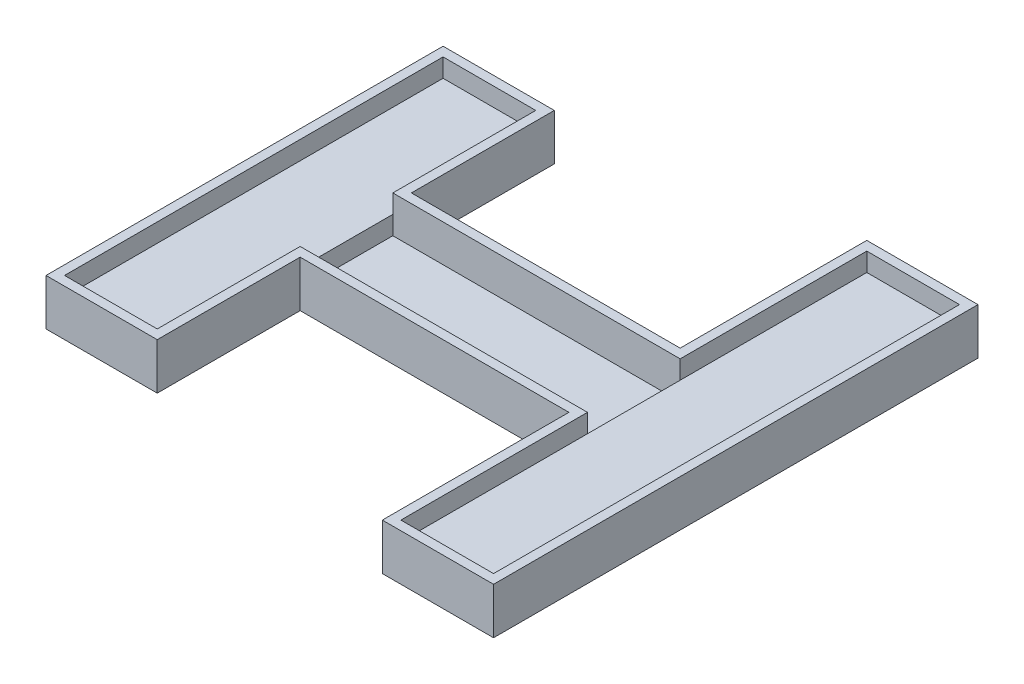
ISO-10303-21;
HEADER;
FILE_DESCRIPTION(('STEP AP214'),'2;1');
FILE_NAME('part.step','',(''),(''),'','','');
FILE_SCHEMA(('AUTOMOTIVE_DESIGN { 1 0 10303 214 1 1 1 1 }'));
ENDSEC;
DATA;
#1=APPLICATION_CONTEXT('core data for automotive mechanical design processes');
#2=APPLICATION_PROTOCOL_DEFINITION('international standard','automotive_design',2000,#1);
#3=PRODUCT_CONTEXT('',#1,'mechanical');
#4=PRODUCT('Part','Part','',(#3));
#5=PRODUCT_RELATED_PRODUCT_CATEGORY('part','',(#4));
#6=PRODUCT_DEFINITION_FORMATION('','',#4);
#7=PRODUCT_DEFINITION_CONTEXT('part definition',#1,'design');
#8=PRODUCT_DEFINITION('design','',#6,#7);
#9=PRODUCT_DEFINITION_SHAPE('','',#8);
#10=(LENGTH_UNIT() NAMED_UNIT(*) SI_UNIT(.MILLI.,.METRE.));
#11=(NAMED_UNIT(*) PLANE_ANGLE_UNIT() SI_UNIT($,.RADIAN.));
#12=(NAMED_UNIT(*) SI_UNIT($,.STERADIAN.) SOLID_ANGLE_UNIT());
#13=UNCERTAINTY_MEASURE_WITH_UNIT(LENGTH_MEASURE(1.E-05),#10,'distance_accuracy_value','');
#14=(GEOMETRIC_REPRESENTATION_CONTEXT(3) GLOBAL_UNCERTAINTY_ASSIGNED_CONTEXT((#13)) GLOBAL_UNIT_ASSIGNED_CONTEXT((#10,
#11,#12)) REPRESENTATION_CONTEXT('',''));
#15=CARTESIAN_POINT('',(0.,0.,0.));
#16=DIRECTION('',(0.,0.,1.));
#17=DIRECTION('',(1.,0.,0.));
#18=AXIS2_PLACEMENT_3D('',#15,#16,#17);
#19=CARTESIAN_POINT('',(0.,1.,0.));
#20=DIRECTION('',(0.,1.,0.));
#21=DIRECTION('',(0.,0.,1.));
#22=AXIS2_PLACEMENT_3D('',#19,#20,#21);
#23=PLANE('',#22);
#24=DIRECTION('',(1.,0.,0.));
#25=VECTOR('',#24,1.);
#26=CARTESIAN_POINT('',(0.,1.,5.));
#27=LINE('',#26,#25);
#28=CARTESIAN_POINT('',(-15.5,1.,5.));
#29=VERTEX_POINT('',#28);
#30=CARTESIAN_POINT('',(15.5,1.,5.));
#31=VERTEX_POINT('',#30);
#32=EDGE_CURVE('E411',#29,#31,#27,.T.);
#33=ORIENTED_EDGE('',*,*,#32,.T.);
#34=DIRECTION('',(0.,0.,1.));
#35=VECTOR('',#34,1.);
#36=CARTESIAN_POINT('',(15.5,1.,0.));
#37=LINE('',#36,#35);
#38=CARTESIAN_POINT('',(15.5,1.,-5.));
#39=VERTEX_POINT('',#38);
#40=EDGE_CURVE('E231',#39,#31,#37,.T.);
#41=ORIENTED_EDGE('',*,*,#40,.F.);
#42=DIRECTION('',(1.,0.,0.));
#43=VECTOR('',#42,1.);
#44=CARTESIAN_POINT('',(0.,1.,-5.));
#45=LINE('',#44,#43);
#46=CARTESIAN_POINT('',(-15.5,1.,-5.));
#47=VERTEX_POINT('',#46);
#48=EDGE_CURVE('E41',#47,#39,#45,.T.);
#49=ORIENTED_EDGE('',*,*,#48,.F.);
#50=DIRECTION('',(0.,0.,1.));
#51=VECTOR('',#50,1.);
#52=CARTESIAN_POINT('',(-15.5,1.,0.));
#53=LINE('',#52,#51);
#54=EDGE_CURVE('E11',#47,#29,#53,.T.);
#55=ORIENTED_EDGE('',*,*,#54,.T.);
#56=EDGE_LOOP('',(#33,#41,#49,#55));
#57=FACE_BOUND('',#56,.T.);
#58=ADVANCED_FACE('F37',(#57),#23,.T.);
#59=CARTESIAN_POINT('',(-15.5,1.,0.));
#60=DIRECTION('',(-1.,0.,0.));
#61=DIRECTION('',(0.,0.,1.));
#62=AXIS2_PLACEMENT_3D('',#59,#60,#61);
#63=PLANE('',#62);
#64=DIRECTION('',(0.,1.,0.));
#65=VECTOR('',#64,1.);
#66=CARTESIAN_POINT('',(-15.5,0.,-5.));
#67=LINE('',#66,#65);
#68=CARTESIAN_POINT('',(-15.5,3.,-5.));
#69=VERTEX_POINT('',#68);
#70=EDGE_CURVE('E321',#47,#69,#67,.T.);
#71=ORIENTED_EDGE('',*,*,#70,.T.);
#72=DIRECTION('',(0.,0.,1.));
#73=VECTOR('',#72,1.);
#74=CARTESIAN_POINT('',(-15.5,3.,0.));
#75=LINE('',#74,#73);
#76=CARTESIAN_POINT('',(-15.5,3.,5.));
#77=VERTEX_POINT('',#76);
#78=EDGE_CURVE('E403',#69,#77,#75,.T.);
#79=ORIENTED_EDGE('',*,*,#78,.T.);
#80=DIRECTION('',(0.,1.,0.));
#81=VECTOR('',#80,1.);
#82=CARTESIAN_POINT('',(-15.5,0.,5.));
#83=LINE('',#82,#81);
#84=EDGE_CURVE('E220',#29,#77,#83,.T.);
#85=ORIENTED_EDGE('',*,*,#84,.F.);
#86=ORIENTED_EDGE('',*,*,#54,.F.);
#87=EDGE_LOOP('',(#71,#79,#85,#86));
#88=FACE_BOUND('',#87,.T.);
#89=ADVANCED_FACE('F39',(#88),#63,.F.);
#90=CARTESIAN_POINT('',(0.,3.,0.));
#91=DIRECTION('',(0.,1.,0.));
#92=DIRECTION('',(0.,0.,1.));
#93=AXIS2_PLACEMENT_3D('',#90,#91,#92);
#94=PLANE('',#93);
#95=CARTESIAN_POINT('',(-15.5,3.,-20.42));
#96=VERTEX_POINT('',#95);
#97=EDGE_CURVE('E400',#96,#69,#75,.T.);
#98=ORIENTED_EDGE('',*,*,#97,.F.);
#99=DIRECTION('',(-1.,0.,0.));
#100=VECTOR('',#99,1.);
#101=CARTESIAN_POINT('',(0.,3.,-20.42));
#102=LINE('',#101,#100);
#103=CARTESIAN_POINT('',(-25.5,3.,-20.42));
#104=VERTEX_POINT('',#103);
#105=EDGE_CURVE('E402',#96,#104,#102,.T.);
#106=ORIENTED_EDGE('',*,*,#105,.T.);
#107=DIRECTION('',(0.,0.,1.));
#108=VECTOR('',#107,1.);
#109=CARTESIAN_POINT('',(-25.5,3.,0.));
#110=LINE('',#109,#108);
#111=CARTESIAN_POINT('',(-25.5,3.,20.42));
#112=VERTEX_POINT('',#111);
#113=EDGE_CURVE('E406',#104,#112,#110,.T.);
#114=ORIENTED_EDGE('',*,*,#113,.T.);
#115=DIRECTION('',(1.,0.,0.));
#116=VECTOR('',#115,1.);
#117=CARTESIAN_POINT('',(0.,3.,20.42));
#118=LINE('',#117,#116);
#119=CARTESIAN_POINT('',(-15.5,3.,20.42));
#120=VERTEX_POINT('',#119);
#121=EDGE_CURVE('E409',#112,#120,#118,.T.);
#122=ORIENTED_EDGE('',*,*,#121,.T.);
#123=EDGE_CURVE('E378',#77,#120,#75,.T.);
#124=ORIENTED_EDGE('',*,*,#123,.F.);
#125=ORIENTED_EDGE('',*,*,#78,.F.);
#126=EDGE_LOOP('',(#98,#106,#114,#122,#124,#125));
#127=FACE_BOUND('',#126,.T.);
#128=ADVANCED_FACE('F428',(#127),#94,.T.);
#129=CARTESIAN_POINT('',(-14.5,0.,-21.42));
#130=DIRECTION('',(0.,0.,-1.));
#131=DIRECTION('',(-1.,0.,0.));
#132=AXIS2_PLACEMENT_3D('',#129,#130,#131);
#133=PLANE('',#132);
#134=DIRECTION('',(0.,1.,0.));
#135=VECTOR('',#134,1.);
#136=CARTESIAN_POINT('',(-26.5,0.,-21.42));
#137=LINE('',#136,#135);
#138=CARTESIAN_POINT('',(-26.5,0.,-21.42));
#139=VERTEX_POINT('',#138);
#140=CARTESIAN_POINT('',(-26.5,5.,-21.42));
#141=VERTEX_POINT('',#140);
#142=EDGE_CURVE('E375',#139,#141,#137,.T.);
#143=ORIENTED_EDGE('',*,*,#142,.T.);
#144=DIRECTION('',(-1.,0.,0.));
#145=VECTOR('',#144,1.);
#146=CARTESIAN_POINT('',(-14.5,5.,-21.42));
#147=LINE('',#146,#145);
#148=CARTESIAN_POINT('',(-14.5,5.,-21.42));
#149=VERTEX_POINT('',#148);
#150=EDGE_CURVE('E281',#149,#141,#147,.T.);
#151=ORIENTED_EDGE('',*,*,#150,.F.);
#152=DIRECTION('',(0.,1.,0.));
#153=VECTOR('',#152,1.);
#154=CARTESIAN_POINT('',(-14.5,0.,-21.42));
#155=LINE('',#154,#153);
#156=CARTESIAN_POINT('',(-14.5,0.,-21.42));
#157=VERTEX_POINT('',#156);
#158=EDGE_CURVE('E376',#157,#149,#155,.T.);
#159=ORIENTED_EDGE('',*,*,#158,.F.);
#160=DIRECTION('',(-1.,0.,0.));
#161=VECTOR('',#160,1.);
#162=CARTESIAN_POINT('',(-14.5,0.,-21.42));
#163=LINE('',#162,#161);
#164=EDGE_CURVE('E320',#157,#139,#163,.T.);
#165=ORIENTED_EDGE('',*,*,#164,.T.);
#166=EDGE_LOOP('',(#143,#151,#159,#165));
#167=FACE_BOUND('',#166,.T.);
#168=ADVANCED_FACE('F535',(#167),#133,.T.);
#169=CARTESIAN_POINT('',(-14.5,0.,-6.));
#170=DIRECTION('',(1.,0.,0.));
#171=DIRECTION('',(0.,0.,-1.));
#172=AXIS2_PLACEMENT_3D('',#169,#170,#171);
#173=PLANE('',#172);
#174=ORIENTED_EDGE('',*,*,#158,.T.);
#175=DIRECTION('',(0.,0.,-1.));
#176=VECTOR('',#175,1.);
#177=CARTESIAN_POINT('',(-14.5,5.,-6.));
#178=LINE('',#177,#176);
#179=CARTESIAN_POINT('',(-14.5,5.,-6.));
#180=VERTEX_POINT('',#179);
#181=EDGE_CURVE('E314',#180,#149,#178,.T.);
#182=ORIENTED_EDGE('',*,*,#181,.F.);
#183=DIRECTION('',(0.,1.,0.));
#184=VECTOR('',#183,1.);
#185=CARTESIAN_POINT('',(-14.5,0.,-6.));
#186=LINE('',#185,#184);
#187=CARTESIAN_POINT('',(-14.5,0.,-6.));
#188=VERTEX_POINT('',#187);
#189=EDGE_CURVE('E379',#188,#180,#186,.T.);
#190=ORIENTED_EDGE('',*,*,#189,.F.);
#191=DIRECTION('',(0.,0.,-1.));
#192=VECTOR('',#191,1.);
#193=CARTESIAN_POINT('',(-14.5,0.,-6.));
#194=LINE('',#193,#192);
#195=EDGE_CURVE('E372',#188,#157,#194,.T.);
#196=ORIENTED_EDGE('',*,*,#195,.T.);
#197=EDGE_LOOP('',(#174,#182,#190,#196));
#198=FACE_BOUND('',#197,.T.);
#199=ADVANCED_FACE('F495',(#198),#173,.T.);
#200=CARTESIAN_POINT('',(14.5,0.,-6.00000000000001));
#201=DIRECTION('',(0.,0.,-1.));
#202=DIRECTION('',(-1.,0.,0.));
#203=AXIS2_PLACEMENT_3D('',#200,#201,#202);
#204=PLANE('',#203);
#205=ORIENTED_EDGE('',*,*,#189,.T.);
#206=DIRECTION('',(-1.,0.,0.));
#207=VECTOR('',#206,1.);
#208=CARTESIAN_POINT('',(14.5,5.,-6.00000000000001));
#209=LINE('',#208,#207);
#210=CARTESIAN_POINT('',(14.5,5.,-6.00000000000001));
#211=VERTEX_POINT('',#210);
#212=EDGE_CURVE('E311',#211,#180,#209,.T.);
#213=ORIENTED_EDGE('',*,*,#212,.F.);
#214=DIRECTION('',(0.,1.,0.));
#215=VECTOR('',#214,1.);
#216=CARTESIAN_POINT('',(14.5,0.,-6.00000000000001));
#217=LINE('',#216,#215);
#218=CARTESIAN_POINT('',(14.5,0.,-6.00000000000001));
#219=VERTEX_POINT('',#218);
#220=EDGE_CURVE('E381',#219,#211,#217,.T.);
#221=ORIENTED_EDGE('',*,*,#220,.F.);
#222=DIRECTION('',(-1.,0.,0.));
#223=VECTOR('',#222,1.);
#224=CARTESIAN_POINT('',(14.5,0.,-6.00000000000001));
#225=LINE('',#224,#223);
#226=EDGE_CURVE('E369',#219,#188,#225,.T.);
#227=ORIENTED_EDGE('',*,*,#226,.T.);
#228=EDGE_LOOP('',(#205,#213,#221,#227));
#229=FACE_BOUND('',#228,.T.);
#230=ADVANCED_FACE('F499',(#229),#204,.T.);
#231=CARTESIAN_POINT('',(14.5,0.,-26.133));
#232=DIRECTION('',(-1.,0.,0.));
#233=DIRECTION('',(0.,0.,1.));
#234=AXIS2_PLACEMENT_3D('',#231,#232,#233);
#235=PLANE('',#234);
#236=ORIENTED_EDGE('',*,*,#220,.T.);
#237=DIRECTION('',(0.,0.,1.));
#238=VECTOR('',#237,1.);
#239=CARTESIAN_POINT('',(14.5,5.,-26.133));
#240=LINE('',#239,#238);
#241=CARTESIAN_POINT('',(14.5,5.,-26.133));
#242=VERTEX_POINT('',#241);
#243=EDGE_CURVE('E308',#242,#211,#240,.T.);
#244=ORIENTED_EDGE('',*,*,#243,.F.);
#245=DIRECTION('',(0.,1.,0.));
#246=VECTOR('',#245,1.);
#247=CARTESIAN_POINT('',(14.5,0.,-26.133));
#248=LINE('',#247,#246);
#249=CARTESIAN_POINT('',(14.5,0.,-26.133));
#250=VERTEX_POINT('',#249);
#251=EDGE_CURVE('E383',#250,#242,#248,.T.);
#252=ORIENTED_EDGE('',*,*,#251,.F.);
#253=DIRECTION('',(0.,0.,1.));
#254=VECTOR('',#253,1.);
#255=CARTESIAN_POINT('',(14.5,0.,-26.133));
#256=LINE('',#255,#254);
#257=EDGE_CURVE('E366',#250,#219,#256,.T.);
#258=ORIENTED_EDGE('',*,*,#257,.T.);
#259=EDGE_LOOP('',(#236,#244,#252,#258));
#260=FACE_BOUND('',#259,.T.);
#261=ADVANCED_FACE('F503',(#260),#235,.T.);
#262=CARTESIAN_POINT('',(26.5,0.,-26.133));
#263=DIRECTION('',(0.,0.,-1.));
#264=DIRECTION('',(-1.,0.,0.));
#265=AXIS2_PLACEMENT_3D('',#262,#263,#264);
#266=PLANE('',#265);
#267=ORIENTED_EDGE('',*,*,#251,.T.);
#268=DIRECTION('',(-1.,0.,0.));
#269=VECTOR('',#268,1.);
#270=CARTESIAN_POINT('',(26.5,5.,-26.133));
#271=LINE('',#270,#269);
#272=CARTESIAN_POINT('',(26.5,5.,-26.133));
#273=VERTEX_POINT('',#272);
#274=EDGE_CURVE('E305',#273,#242,#271,.T.);
#275=ORIENTED_EDGE('',*,*,#274,.F.);
#276=DIRECTION('',(0.,1.,0.));
#277=VECTOR('',#276,1.);
#278=CARTESIAN_POINT('',(26.5,0.,-26.133));
#279=LINE('',#278,#277);
#280=CARTESIAN_POINT('',(26.5,0.,-26.133));
#281=VERTEX_POINT('',#280);
#282=EDGE_CURVE('E385',#281,#273,#279,.T.);
#283=ORIENTED_EDGE('',*,*,#282,.F.);
#284=DIRECTION('',(-1.,0.,0.));
#285=VECTOR('',#284,1.);
#286=CARTESIAN_POINT('',(26.5,0.,-26.133));
#287=LINE('',#286,#285);
#288=EDGE_CURVE('E363',#281,#250,#287,.T.);
#289=ORIENTED_EDGE('',*,*,#288,.T.);
#290=EDGE_LOOP('',(#267,#275,#283,#289));
#291=FACE_BOUND('',#290,.T.);
#292=ADVANCED_FACE('F507',(#291),#266,.T.);
#293=CARTESIAN_POINT('',(26.5,0.,26.133));
#294=DIRECTION('',(1.,0.,0.));
#295=DIRECTION('',(0.,0.,-1.));
#296=AXIS2_PLACEMENT_3D('',#293,#294,#295);
#297=PLANE('',#296);
#298=ORIENTED_EDGE('',*,*,#282,.T.);
#299=DIRECTION('',(0.,0.,-1.));
#300=VECTOR('',#299,1.);
#301=CARTESIAN_POINT('',(26.5,5.,26.133));
#302=LINE('',#301,#300);
#303=CARTESIAN_POINT('',(26.5,5.,26.133));
#304=VERTEX_POINT('',#303);
#305=EDGE_CURVE('E302',#304,#273,#302,.T.);
#306=ORIENTED_EDGE('',*,*,#305,.F.);
#307=DIRECTION('',(0.,1.,0.));
#308=VECTOR('',#307,1.);
#309=CARTESIAN_POINT('',(26.5,0.,26.133));
#310=LINE('',#309,#308);
#311=CARTESIAN_POINT('',(26.5,0.,26.133));
#312=VERTEX_POINT('',#311);
#313=EDGE_CURVE('E387',#312,#304,#310,.T.);
#314=ORIENTED_EDGE('',*,*,#313,.F.);
#315=DIRECTION('',(0.,0.,-1.));
#316=VECTOR('',#315,1.);
#317=CARTESIAN_POINT('',(26.5,0.,26.133));
#318=LINE('',#317,#316);
#319=EDGE_CURVE('E360',#312,#281,#318,.T.);
#320=ORIENTED_EDGE('',*,*,#319,.T.);
#321=EDGE_LOOP('',(#298,#306,#314,#320));
#322=FACE_BOUND('',#321,.T.);
#323=ADVANCED_FACE('F511',(#322),#297,.T.);
#324=CARTESIAN_POINT('',(14.5,0.,26.133));
#325=DIRECTION('',(0.,0.,1.));
#326=DIRECTION('',(1.,0.,0.));
#327=AXIS2_PLACEMENT_3D('',#324,#325,#326);
#328=PLANE('',#327);
#329=ORIENTED_EDGE('',*,*,#313,.T.);
#330=DIRECTION('',(1.,0.,0.));
#331=VECTOR('',#330,1.);
#332=CARTESIAN_POINT('',(14.5,5.,26.133));
#333=LINE('',#332,#331);
#334=CARTESIAN_POINT('',(14.5,5.,26.133));
#335=VERTEX_POINT('',#334);
#336=EDGE_CURVE('E299',#335,#304,#333,.T.);
#337=ORIENTED_EDGE('',*,*,#336,.F.);
#338=DIRECTION('',(0.,1.,0.));
#339=VECTOR('',#338,1.);
#340=CARTESIAN_POINT('',(14.5,0.,26.133));
#341=LINE('',#340,#339);
#342=CARTESIAN_POINT('',(14.5,0.,26.133));
#343=VERTEX_POINT('',#342);
#344=EDGE_CURVE('E389',#343,#335,#341,.T.);
#345=ORIENTED_EDGE('',*,*,#344,.F.);
#346=DIRECTION('',(1.,0.,0.));
#347=VECTOR('',#346,1.);
#348=CARTESIAN_POINT('',(14.5,0.,26.133));
#349=LINE('',#348,#347);
#350=EDGE_CURVE('E357',#343,#312,#349,.T.);
#351=ORIENTED_EDGE('',*,*,#350,.T.);
#352=EDGE_LOOP('',(#329,#337,#345,#351));
#353=FACE_BOUND('',#352,.T.);
#354=ADVANCED_FACE('F516',(#353),#328,.T.);
#355=CARTESIAN_POINT('',(14.5,0.,6.));
#356=DIRECTION('',(-1.,0.,0.));
#357=DIRECTION('',(0.,0.,1.));
#358=AXIS2_PLACEMENT_3D('',#355,#356,#357);
#359=PLANE('',#358);
#360=ORIENTED_EDGE('',*,*,#344,.T.);
#361=DIRECTION('',(0.,0.,1.));
#362=VECTOR('',#361,1.);
#363=CARTESIAN_POINT('',(14.5,5.,6.));
#364=LINE('',#363,#362);
#365=CARTESIAN_POINT('',(14.5,5.,6.));
#366=VERTEX_POINT('',#365);
#367=EDGE_CURVE('E296',#366,#335,#364,.T.);
#368=ORIENTED_EDGE('',*,*,#367,.F.);
#369=DIRECTION('',(0.,1.,0.));
#370=VECTOR('',#369,1.);
#371=CARTESIAN_POINT('',(14.5,0.,6.));
#372=LINE('',#371,#370);
#373=CARTESIAN_POINT('',(14.5,0.,6.));
#374=VERTEX_POINT('',#373);
#375=EDGE_CURVE('E391',#374,#366,#372,.T.);
#376=ORIENTED_EDGE('',*,*,#375,.F.);
#377=DIRECTION('',(0.,0.,1.));
#378=VECTOR('',#377,1.);
#379=CARTESIAN_POINT('',(14.5,0.,6.));
#380=LINE('',#379,#378);
#381=EDGE_CURVE('E354',#374,#343,#380,.T.);
#382=ORIENTED_EDGE('',*,*,#381,.T.);
#383=EDGE_LOOP('',(#360,#368,#376,#382));
#384=FACE_BOUND('',#383,.T.);
#385=ADVANCED_FACE('F519',(#384),#359,.T.);
#386=CARTESIAN_POINT('',(-14.5,0.,6.));
#387=DIRECTION('',(0.,0.,1.));
#388=DIRECTION('',(1.,0.,0.));
#389=AXIS2_PLACEMENT_3D('',#386,#387,#388);
#390=PLANE('',#389);
#391=ORIENTED_EDGE('',*,*,#375,.T.);
#392=DIRECTION('',(1.,0.,0.));
#393=VECTOR('',#392,1.);
#394=CARTESIAN_POINT('',(-14.5,5.,6.));
#395=LINE('',#394,#393);
#396=CARTESIAN_POINT('',(-14.5,5.,6.));
#397=VERTEX_POINT('',#396);
#398=EDGE_CURVE('E293',#397,#366,#395,.T.);
#399=ORIENTED_EDGE('',*,*,#398,.F.);
#400=DIRECTION('',(0.,1.,0.));
#401=VECTOR('',#400,1.);
#402=CARTESIAN_POINT('',(-14.5,0.,6.));
#403=LINE('',#402,#401);
#404=CARTESIAN_POINT('',(-14.5,0.,6.));
#405=VERTEX_POINT('',#404);
#406=EDGE_CURVE('E393',#405,#397,#403,.T.);
#407=ORIENTED_EDGE('',*,*,#406,.F.);
#408=DIRECTION('',(1.,0.,0.));
#409=VECTOR('',#408,1.);
#410=CARTESIAN_POINT('',(-14.5,0.,6.));
#411=LINE('',#410,#409);
#412=EDGE_CURVE('E351',#405,#374,#411,.T.);
#413=ORIENTED_EDGE('',*,*,#412,.T.);
#414=EDGE_LOOP('',(#391,#399,#407,#413));
#415=FACE_BOUND('',#414,.T.);
#416=ADVANCED_FACE('F523',(#415),#390,.T.);
#417=CARTESIAN_POINT('',(-14.5,0.,21.42));
#418=DIRECTION('',(1.,0.,0.));
#419=DIRECTION('',(0.,0.,-1.));
#420=AXIS2_PLACEMENT_3D('',#417,#418,#419);
#421=PLANE('',#420);
#422=ORIENTED_EDGE('',*,*,#406,.T.);
#423=DIRECTION('',(0.,0.,-1.));
#424=VECTOR('',#423,1.);
#425=CARTESIAN_POINT('',(-14.5,5.,21.42));
#426=LINE('',#425,#424);
#427=CARTESIAN_POINT('',(-14.5,5.,21.42));
#428=VERTEX_POINT('',#427);
#429=EDGE_CURVE('E290',#428,#397,#426,.T.);
#430=ORIENTED_EDGE('',*,*,#429,.F.);
#431=DIRECTION('',(0.,1.,0.));
#432=VECTOR('',#431,1.);
#433=CARTESIAN_POINT('',(-14.5,0.,21.42));
#434=LINE('',#433,#432);
#435=CARTESIAN_POINT('',(-14.5,0.,21.42));
#436=VERTEX_POINT('',#435);
#437=EDGE_CURVE('E395',#436,#428,#434,.T.);
#438=ORIENTED_EDGE('',*,*,#437,.F.);
#439=DIRECTION('',(0.,0.,-1.));
#440=VECTOR('',#439,1.);
#441=CARTESIAN_POINT('',(-14.5,0.,21.42));
#442=LINE('',#441,#440);
#443=EDGE_CURVE('E348',#436,#405,#442,.T.);
#444=ORIENTED_EDGE('',*,*,#443,.T.);
#445=EDGE_LOOP('',(#422,#430,#438,#444));
#446=FACE_BOUND('',#445,.T.);
#447=ADVANCED_FACE('F527',(#446),#421,.T.);
#448=CARTESIAN_POINT('',(-26.5,0.,21.42));
#449=DIRECTION('',(0.,0.,1.));
#450=DIRECTION('',(1.,0.,0.));
#451=AXIS2_PLACEMENT_3D('',#448,#449,#450);
#452=PLANE('',#451);
#453=ORIENTED_EDGE('',*,*,#437,.T.);
#454=DIRECTION('',(1.,0.,0.));
#455=VECTOR('',#454,1.);
#456=CARTESIAN_POINT('',(-26.5,5.,21.42));
#457=LINE('',#456,#455);
#458=CARTESIAN_POINT('',(-26.5,5.,21.42));
#459=VERTEX_POINT('',#458);
#460=EDGE_CURVE('E287',#459,#428,#457,.T.);
#461=ORIENTED_EDGE('',*,*,#460,.F.);
#462=DIRECTION('',(0.,1.,0.));
#463=VECTOR('',#462,1.);
#464=CARTESIAN_POINT('',(-26.5,0.,21.42));
#465=LINE('',#464,#463);
#466=CARTESIAN_POINT('',(-26.5,0.,21.42));
#467=VERTEX_POINT('',#466);
#468=EDGE_CURVE('E397',#467,#459,#465,.T.);
#469=ORIENTED_EDGE('',*,*,#468,.F.);
#470=DIRECTION('',(1.,0.,0.));
#471=VECTOR('',#470,1.);
#472=CARTESIAN_POINT('',(-26.5,0.,21.42));
#473=LINE('',#472,#471);
#474=EDGE_CURVE('E345',#467,#436,#473,.T.);
#475=ORIENTED_EDGE('',*,*,#474,.T.);
#476=EDGE_LOOP('',(#453,#461,#469,#475));
#477=FACE_BOUND('',#476,.T.);
#478=ADVANCED_FACE('F530',(#477),#452,.T.);
#479=CARTESIAN_POINT('',(-26.5,0.,-21.42));
#480=DIRECTION('',(-1.,0.,0.));
#481=DIRECTION('',(0.,0.,1.));
#482=AXIS2_PLACEMENT_3D('',#479,#480,#481);
#483=PLANE('',#482);
#484=ORIENTED_EDGE('',*,*,#468,.T.);
#485=DIRECTION('',(0.,0.,1.));
#486=VECTOR('',#485,1.);
#487=CARTESIAN_POINT('',(-26.5,5.,-21.42));
#488=LINE('',#487,#486);
#489=EDGE_CURVE('E284',#141,#459,#488,.T.);
#490=ORIENTED_EDGE('',*,*,#489,.F.);
#491=ORIENTED_EDGE('',*,*,#142,.F.);
#492=DIRECTION('',(0.,0.,1.));
#493=VECTOR('',#492,1.);
#494=CARTESIAN_POINT('',(-26.5,0.,-21.42));
#495=LINE('',#494,#493);
#496=EDGE_CURVE('E342',#139,#467,#495,.T.);
#497=ORIENTED_EDGE('',*,*,#496,.T.);
#498=EDGE_LOOP('',(#484,#490,#491,#497));
#499=FACE_BOUND('',#498,.T.);
#500=ADVANCED_FACE('F534',(#499),#483,.T.);
#501=CARTESIAN_POINT('',(-15.5,0.,-20.42));
#502=DIRECTION('',(0.,0.,-1.));
#503=DIRECTION('',(-1.,0.,0.));
#504=AXIS2_PLACEMENT_3D('',#501,#502,#503);
#505=PLANE('',#504);
#506=ORIENTED_EDGE('',*,*,#105,.F.);
#507=DIRECTION('',(0.,1.,0.));
#508=VECTOR('',#507,1.);
#509=CARTESIAN_POINT('',(-15.5,0.,-20.42));
#510=LINE('',#509,#508);
#511=CARTESIAN_POINT('',(-15.5,5.,-20.42));
#512=VERTEX_POINT('',#511);
#513=EDGE_CURVE('E318',#96,#512,#510,.T.);
#514=ORIENTED_EDGE('',*,*,#513,.T.);
#515=DIRECTION('',(-1.,0.,0.));
#516=VECTOR('',#515,1.);
#517=CARTESIAN_POINT('',(-15.5,5.,-20.42));
#518=LINE('',#517,#516);
#519=CARTESIAN_POINT('',(-25.5,5.,-20.42));
#520=VERTEX_POINT('',#519);
#521=EDGE_CURVE('E248',#512,#520,#518,.T.);
#522=ORIENTED_EDGE('',*,*,#521,.T.);
#523=DIRECTION('',(0.,1.,0.));
#524=VECTOR('',#523,1.);
#525=CARTESIAN_POINT('',(-25.5,0.,-20.42));
#526=LINE('',#525,#524);
#527=EDGE_CURVE('E317',#104,#520,#526,.T.);
#528=ORIENTED_EDGE('',*,*,#527,.F.);
#529=EDGE_LOOP('',(#506,#514,#522,#528));
#530=FACE_BOUND('',#529,.T.);
#531=ADVANCED_FACE('F461',(#530),#505,.F.);
#532=CARTESIAN_POINT('',(-15.5,0.,-5.));
#533=DIRECTION('',(1.,0.,0.));
#534=DIRECTION('',(0.,0.,-1.));
#535=AXIS2_PLACEMENT_3D('',#532,#533,#534);
#536=PLANE('',#535);
#537=ORIENTED_EDGE('',*,*,#97,.T.);
#538=CARTESIAN_POINT('',(-15.5,5.,-5.));
#539=VERTEX_POINT('',#538);
#540=EDGE_CURVE('E322',#69,#539,#67,.T.);
#541=ORIENTED_EDGE('',*,*,#540,.T.);
#542=DIRECTION('',(0.,0.,-1.));
#543=VECTOR('',#542,1.);
#544=CARTESIAN_POINT('',(-15.5,5.,-5.));
#545=LINE('',#544,#543);
#546=EDGE_CURVE('E278',#539,#512,#545,.T.);
#547=ORIENTED_EDGE('',*,*,#546,.T.);
#548=ORIENTED_EDGE('',*,*,#513,.F.);
#549=EDGE_LOOP('',(#537,#541,#547,#548));
#550=FACE_BOUND('',#549,.T.);
#551=ADVANCED_FACE('F457',(#550),#536,.F.);
#552=CARTESIAN_POINT('',(15.5,0.,-5.));
#553=DIRECTION('',(0.,0.,-1.));
#554=DIRECTION('',(-1.,0.,0.));
#555=AXIS2_PLACEMENT_3D('',#552,#553,#554);
#556=PLANE('',#555);
#557=ORIENTED_EDGE('',*,*,#48,.T.);
#558=DIRECTION('',(0.,1.,0.));
#559=VECTOR('',#558,1.);
#560=CARTESIAN_POINT('',(15.5,0.,-5.));
#561=LINE('',#560,#559);
#562=CARTESIAN_POINT('',(15.5,3.,-5.));
#563=VERTEX_POINT('',#562);
#564=EDGE_CURVE('E324',#39,#563,#561,.T.);
#565=ORIENTED_EDGE('',*,*,#564,.T.);
#566=CARTESIAN_POINT('',(15.5,5.,-5.));
#567=VERTEX_POINT('',#566);
#568=EDGE_CURVE('E53',#563,#567,#561,.T.);
#569=ORIENTED_EDGE('',*,*,#568,.T.);
#570=DIRECTION('',(-1.,0.,0.));
#571=VECTOR('',#570,1.);
#572=CARTESIAN_POINT('',(15.5,5.,-5.));
#573=LINE('',#572,#571);
#574=EDGE_CURVE('E275',#567,#539,#573,.T.);
#575=ORIENTED_EDGE('',*,*,#574,.T.);
#576=ORIENTED_EDGE('',*,*,#540,.F.);
#577=ORIENTED_EDGE('',*,*,#70,.F.);
#578=EDGE_LOOP('',(#557,#565,#569,#575,#576,#577));
#579=FACE_BOUND('',#578,.T.);
#580=ADVANCED_FACE('F416',(#579),#556,.F.);
#581=CARTESIAN_POINT('',(15.5,0.,-25.133));
#582=DIRECTION('',(-1.,0.,0.));
#583=DIRECTION('',(0.,0.,1.));
#584=AXIS2_PLACEMENT_3D('',#581,#582,#583);
#585=PLANE('',#584);
#586=ORIENTED_EDGE('',*,*,#568,.F.);
#587=DIRECTION('',(0.,0.,1.));
#588=VECTOR('',#587,1.);
#589=CARTESIAN_POINT('',(15.5,3.,0.));
#590=LINE('',#589,#588);
#591=CARTESIAN_POINT('',(15.5,3.,-25.133));
#592=VERTEX_POINT('',#591);
#593=EDGE_CURVE('E58',#592,#563,#590,.T.);
#594=ORIENTED_EDGE('',*,*,#593,.F.);
#595=DIRECTION('',(0.,1.,0.));
#596=VECTOR('',#595,1.);
#597=CARTESIAN_POINT('',(15.5,0.,-25.133));
#598=LINE('',#597,#596);
#599=CARTESIAN_POINT('',(15.5,5.,-25.133));
#600=VERTEX_POINT('',#599);
#601=EDGE_CURVE('E326',#592,#600,#598,.T.);
#602=ORIENTED_EDGE('',*,*,#601,.T.);
#603=DIRECTION('',(0.,0.,1.));
#604=VECTOR('',#603,1.);
#605=CARTESIAN_POINT('',(15.5,5.,-25.133));
#606=LINE('',#605,#604);
#607=EDGE_CURVE('E273',#600,#567,#606,.T.);
#608=ORIENTED_EDGE('',*,*,#607,.T.);
#609=EDGE_LOOP('',(#586,#594,#602,#608));
#610=FACE_BOUND('',#609,.T.);
#611=ADVANCED_FACE('F452',(#610),#585,.F.);
#612=CARTESIAN_POINT('',(25.5,0.,-25.133));
#613=DIRECTION('',(0.,0.,-1.));
#614=DIRECTION('',(-1.,0.,0.));
#615=AXIS2_PLACEMENT_3D('',#612,#613,#614);
#616=PLANE('',#615);
#617=ORIENTED_EDGE('',*,*,#601,.F.);
#618=DIRECTION('',(-1.,0.,0.));
#619=VECTOR('',#618,1.);
#620=CARTESIAN_POINT('',(0.,3.,-25.133));
#621=LINE('',#620,#619);
#622=CARTESIAN_POINT('',(25.5,3.,-25.133));
#623=VERTEX_POINT('',#622);
#624=EDGE_CURVE('E246',#623,#592,#621,.T.);
#625=ORIENTED_EDGE('',*,*,#624,.F.);
#626=DIRECTION('',(0.,1.,0.));
#627=VECTOR('',#626,1.);
#628=CARTESIAN_POINT('',(25.5,0.,-25.133));
#629=LINE('',#628,#627);
#630=CARTESIAN_POINT('',(25.5,5.,-25.133));
#631=VERTEX_POINT('',#630);
#632=EDGE_CURVE('E328',#623,#631,#629,.T.);
#633=ORIENTED_EDGE('',*,*,#632,.T.);
#634=DIRECTION('',(-1.,0.,0.));
#635=VECTOR('',#634,1.);
#636=CARTESIAN_POINT('',(25.5,5.,-25.133));
#637=LINE('',#636,#635);
#638=EDGE_CURVE('E270',#631,#600,#637,.T.);
#639=ORIENTED_EDGE('',*,*,#638,.T.);
#640=EDGE_LOOP('',(#617,#625,#633,#639));
#641=FACE_BOUND('',#640,.T.);
#642=ADVANCED_FACE('F450',(#641),#616,.F.);
#643=CARTESIAN_POINT('',(25.5,0.,25.133));
#644=DIRECTION('',(1.,0.,0.));
#645=DIRECTION('',(0.,0.,-1.));
#646=AXIS2_PLACEMENT_3D('',#643,#644,#645);
#647=PLANE('',#646);
#648=ORIENTED_EDGE('',*,*,#632,.F.);
#649=DIRECTION('',(0.,0.,-1.));
#650=VECTOR('',#649,1.);
#651=CARTESIAN_POINT('',(25.5,3.,0.));
#652=LINE('',#651,#650);
#653=CARTESIAN_POINT('',(25.5,3.,25.133));
#654=VERTEX_POINT('',#653);
#655=EDGE_CURVE('E243',#654,#623,#652,.T.);
#656=ORIENTED_EDGE('',*,*,#655,.F.);
#657=DIRECTION('',(0.,1.,0.));
#658=VECTOR('',#657,1.);
#659=CARTESIAN_POINT('',(25.5,0.,25.133));
#660=LINE('',#659,#658);
#661=CARTESIAN_POINT('',(25.5,5.,25.133));
#662=VERTEX_POINT('',#661);
#663=EDGE_CURVE('E330',#654,#662,#660,.T.);
#664=ORIENTED_EDGE('',*,*,#663,.T.);
#665=DIRECTION('',(0.,0.,-1.));
#666=VECTOR('',#665,1.);
#667=CARTESIAN_POINT('',(25.5,5.,25.133));
#668=LINE('',#667,#666);
#669=EDGE_CURVE('E267',#662,#631,#668,.T.);
#670=ORIENTED_EDGE('',*,*,#669,.T.);
#671=EDGE_LOOP('',(#648,#656,#664,#670));
#672=FACE_BOUND('',#671,.T.);
#673=ADVANCED_FACE('F448',(#672),#647,.F.);
#674=CARTESIAN_POINT('',(15.5,0.,25.133));
#675=DIRECTION('',(0.,0.,1.));
#676=DIRECTION('',(1.,0.,0.));
#677=AXIS2_PLACEMENT_3D('',#674,#675,#676);
#678=PLANE('',#677);
#679=ORIENTED_EDGE('',*,*,#663,.F.);
#680=DIRECTION('',(1.,0.,0.));
#681=VECTOR('',#680,1.);
#682=CARTESIAN_POINT('',(0.,3.,25.133));
#683=LINE('',#682,#681);
#684=CARTESIAN_POINT('',(15.5,3.,25.133));
#685=VERTEX_POINT('',#684);
#686=EDGE_CURVE('E240',#685,#654,#683,.T.);
#687=ORIENTED_EDGE('',*,*,#686,.F.);
#688=DIRECTION('',(0.,1.,0.));
#689=VECTOR('',#688,1.);
#690=CARTESIAN_POINT('',(15.5,0.,25.133));
#691=LINE('',#690,#689);
#692=CARTESIAN_POINT('',(15.5,5.,25.133));
#693=VERTEX_POINT('',#692);
#694=EDGE_CURVE('E226',#685,#693,#691,.T.);
#695=ORIENTED_EDGE('',*,*,#694,.T.);
#696=DIRECTION('',(1.,0.,0.));
#697=VECTOR('',#696,1.);
#698=CARTESIAN_POINT('',(15.5,5.,25.133));
#699=LINE('',#698,#697);
#700=EDGE_CURVE('E264',#693,#662,#699,.T.);
#701=ORIENTED_EDGE('',*,*,#700,.T.);
#702=EDGE_LOOP('',(#679,#687,#695,#701));
#703=FACE_BOUND('',#702,.T.);
#704=ADVANCED_FACE('F445',(#703),#678,.F.);
#705=CARTESIAN_POINT('',(15.5,0.,5.));
#706=DIRECTION('',(-1.,0.,0.));
#707=DIRECTION('',(0.,0.,1.));
#708=AXIS2_PLACEMENT_3D('',#705,#706,#707);
#709=PLANE('',#708);
#710=ORIENTED_EDGE('',*,*,#694,.F.);
#711=CARTESIAN_POINT('',(15.5,3.,5.));
#712=VERTEX_POINT('',#711);
#713=EDGE_CURVE('E224',#712,#685,#590,.T.);
#714=ORIENTED_EDGE('',*,*,#713,.F.);
#715=DIRECTION('',(0.,1.,0.));
#716=VECTOR('',#715,1.);
#717=CARTESIAN_POINT('',(15.5,0.,5.));
#718=LINE('',#717,#716);
#719=CARTESIAN_POINT('',(15.5,5.,5.));
#720=VERTEX_POINT('',#719);
#721=EDGE_CURVE('E209',#712,#720,#718,.T.);
#722=ORIENTED_EDGE('',*,*,#721,.T.);
#723=DIRECTION('',(0.,0.,1.));
#724=VECTOR('',#723,1.);
#725=CARTESIAN_POINT('',(15.5,5.,5.));
#726=LINE('',#725,#724);
#727=EDGE_CURVE('E262',#720,#693,#726,.T.);
#728=ORIENTED_EDGE('',*,*,#727,.T.);
#729=EDGE_LOOP('',(#710,#714,#722,#728));
#730=FACE_BOUND('',#729,.T.);
#731=ADVANCED_FACE('F225',(#730),#709,.F.);
#732=CARTESIAN_POINT('',(-15.5,0.,5.));
#733=DIRECTION('',(0.,0.,1.));
#734=DIRECTION('',(1.,0.,0.));
#735=AXIS2_PLACEMENT_3D('',#732,#733,#734);
#736=PLANE('',#735);
#737=ORIENTED_EDGE('',*,*,#32,.F.);
#738=ORIENTED_EDGE('',*,*,#84,.T.);
#739=CARTESIAN_POINT('',(-15.5,5.,5.));
#740=VERTEX_POINT('',#739);
#741=EDGE_CURVE('E333',#77,#740,#83,.T.);
#742=ORIENTED_EDGE('',*,*,#741,.T.);
#743=DIRECTION('',(1.,0.,0.));
#744=VECTOR('',#743,1.);
#745=CARTESIAN_POINT('',(-15.5,5.,5.));
#746=LINE('',#745,#744);
#747=EDGE_CURVE('E216',#740,#720,#746,.T.);
#748=ORIENTED_EDGE('',*,*,#747,.T.);
#749=ORIENTED_EDGE('',*,*,#721,.F.);
#750=EDGE_CURVE('E213',#31,#712,#718,.T.);
#751=ORIENTED_EDGE('',*,*,#750,.F.);
#752=EDGE_LOOP('',(#737,#738,#742,#748,#749,#751));
#753=FACE_BOUND('',#752,.T.);
#754=ADVANCED_FACE('F211',(#753),#736,.F.);
#755=CARTESIAN_POINT('',(-15.5,0.,20.42));
#756=DIRECTION('',(1.,0.,0.));
#757=DIRECTION('',(0.,0.,-1.));
#758=AXIS2_PLACEMENT_3D('',#755,#756,#757);
#759=PLANE('',#758);
#760=ORIENTED_EDGE('',*,*,#123,.T.);
#761=DIRECTION('',(0.,1.,0.));
#762=VECTOR('',#761,1.);
#763=CARTESIAN_POINT('',(-15.5,0.,20.42));
#764=LINE('',#763,#762);
#765=CARTESIAN_POINT('',(-15.5,5.,20.42));
#766=VERTEX_POINT('',#765);
#767=EDGE_CURVE('E335',#120,#766,#764,.T.);
#768=ORIENTED_EDGE('',*,*,#767,.T.);
#769=DIRECTION('',(0.,0.,-1.));
#770=VECTOR('',#769,1.);
#771=CARTESIAN_POINT('',(-15.5,5.,20.42));
#772=LINE('',#771,#770);
#773=EDGE_CURVE('E258',#766,#740,#772,.T.);
#774=ORIENTED_EDGE('',*,*,#773,.T.);
#775=ORIENTED_EDGE('',*,*,#741,.F.);
#776=EDGE_LOOP('',(#760,#768,#774,#775));
#777=FACE_BOUND('',#776,.T.);
#778=ADVANCED_FACE('F432',(#777),#759,.F.);
#779=CARTESIAN_POINT('',(-25.5,0.,20.42));
#780=DIRECTION('',(0.,0.,1.));
#781=DIRECTION('',(1.,0.,0.));
#782=AXIS2_PLACEMENT_3D('',#779,#780,#781);
#783=PLANE('',#782);
#784=ORIENTED_EDGE('',*,*,#121,.F.);
#785=DIRECTION('',(0.,1.,0.));
#786=VECTOR('',#785,1.);
#787=CARTESIAN_POINT('',(-25.5,0.,20.42));
#788=LINE('',#787,#786);
#789=CARTESIAN_POINT('',(-25.5,5.,20.42));
#790=VERTEX_POINT('',#789);
#791=EDGE_CURVE('E337',#112,#790,#788,.T.);
#792=ORIENTED_EDGE('',*,*,#791,.T.);
#793=DIRECTION('',(1.,0.,0.));
#794=VECTOR('',#793,1.);
#795=CARTESIAN_POINT('',(-25.5,5.,20.42));
#796=LINE('',#795,#794);
#797=EDGE_CURVE('E255',#790,#766,#796,.T.);
#798=ORIENTED_EDGE('',*,*,#797,.T.);
#799=ORIENTED_EDGE('',*,*,#767,.F.);
#800=EDGE_LOOP('',(#784,#792,#798,#799));
#801=FACE_BOUND('',#800,.T.);
#802=ADVANCED_FACE('F434',(#801),#783,.F.);
#803=CARTESIAN_POINT('',(-25.5,0.,-20.42));
#804=DIRECTION('',(-1.,0.,0.));
#805=DIRECTION('',(0.,0.,1.));
#806=AXIS2_PLACEMENT_3D('',#803,#804,#805);
#807=PLANE('',#806);
#808=ORIENTED_EDGE('',*,*,#113,.F.);
#809=ORIENTED_EDGE('',*,*,#527,.T.);
#810=DIRECTION('',(0.,0.,1.));
#811=VECTOR('',#810,1.);
#812=CARTESIAN_POINT('',(-25.5,5.,-20.42));
#813=LINE('',#812,#811);
#814=EDGE_CURVE('E252',#520,#790,#813,.T.);
#815=ORIENTED_EDGE('',*,*,#814,.T.);
#816=ORIENTED_EDGE('',*,*,#791,.F.);
#817=EDGE_LOOP('',(#808,#809,#815,#816));
#818=FACE_BOUND('',#817,.T.);
#819=ADVANCED_FACE('F463',(#818),#807,.F.);
#820=CARTESIAN_POINT('',(0.,5.,0.));
#821=DIRECTION('',(0.,1.,0.));
#822=DIRECTION('',(0.,0.,1.));
#823=AXIS2_PLACEMENT_3D('',#820,#821,#822);
#824=PLANE('',#823);
#825=ORIENTED_EDGE('',*,*,#150,.T.);
#826=ORIENTED_EDGE('',*,*,#489,.T.);
#827=ORIENTED_EDGE('',*,*,#460,.T.);
#828=ORIENTED_EDGE('',*,*,#429,.T.);
#829=ORIENTED_EDGE('',*,*,#398,.T.);
#830=ORIENTED_EDGE('',*,*,#367,.T.);
#831=ORIENTED_EDGE('',*,*,#336,.T.);
#832=ORIENTED_EDGE('',*,*,#305,.T.);
#833=ORIENTED_EDGE('',*,*,#274,.T.);
#834=ORIENTED_EDGE('',*,*,#243,.T.);
#835=ORIENTED_EDGE('',*,*,#212,.T.);
#836=ORIENTED_EDGE('',*,*,#181,.T.);
#837=EDGE_LOOP('',(#825,#826,#827,#828,#829,#830,#831,#832,#833,#834,#835,#836));
#838=FACE_BOUND('',#837,.T.);
#839=ORIENTED_EDGE('',*,*,#814,.F.);
#840=ORIENTED_EDGE('',*,*,#521,.F.);
#841=ORIENTED_EDGE('',*,*,#546,.F.);
#842=ORIENTED_EDGE('',*,*,#574,.F.);
#843=ORIENTED_EDGE('',*,*,#607,.F.);
#844=ORIENTED_EDGE('',*,*,#638,.F.);
#845=ORIENTED_EDGE('',*,*,#669,.F.);
#846=ORIENTED_EDGE('',*,*,#700,.F.);
#847=ORIENTED_EDGE('',*,*,#727,.F.);
#848=ORIENTED_EDGE('',*,*,#747,.F.);
#849=ORIENTED_EDGE('',*,*,#773,.F.);
#850=ORIENTED_EDGE('',*,*,#797,.F.);
#851=EDGE_LOOP('',(#839,#840,#841,#842,#843,#844,#845,#846,#847,#848,#849,#850));
#852=FACE_BOUND('',#851,.T.);
#853=ADVANCED_FACE('F439',(#838,#852),#824,.T.);
#854=CARTESIAN_POINT('',(0.,0.,0.));
#855=DIRECTION('',(0.,1.,0.));
#856=DIRECTION('',(0.,0.,1.));
#857=AXIS2_PLACEMENT_3D('',#854,#855,#856);
#858=PLANE('',#857);
#859=ORIENTED_EDGE('',*,*,#164,.F.);
#860=ORIENTED_EDGE('',*,*,#195,.F.);
#861=ORIENTED_EDGE('',*,*,#226,.F.);
#862=ORIENTED_EDGE('',*,*,#257,.F.);
#863=ORIENTED_EDGE('',*,*,#288,.F.);
#864=ORIENTED_EDGE('',*,*,#319,.F.);
#865=ORIENTED_EDGE('',*,*,#350,.F.);
#866=ORIENTED_EDGE('',*,*,#381,.F.);
#867=ORIENTED_EDGE('',*,*,#412,.F.);
#868=ORIENTED_EDGE('',*,*,#443,.F.);
#869=ORIENTED_EDGE('',*,*,#474,.F.);
#870=ORIENTED_EDGE('',*,*,#496,.F.);
#871=EDGE_LOOP('',(#859,#860,#861,#862,#863,#864,#865,#866,#867,#868,#869,#870));
#872=FACE_BOUND('',#871,.T.);
#873=ADVANCED_FACE('F470',(#872),#858,.F.);
#874=CARTESIAN_POINT('',(15.5,3.,0.));
#875=DIRECTION('',(1.,0.,0.));
#876=DIRECTION('',(0.,0.,-1.));
#877=AXIS2_PLACEMENT_3D('',#874,#875,#876);
#878=PLANE('',#877);
#879=EDGE_CURVE('E230',#563,#712,#590,.T.);
#880=ORIENTED_EDGE('',*,*,#879,.F.);
#881=ORIENTED_EDGE('',*,*,#564,.F.);
#882=ORIENTED_EDGE('',*,*,#40,.T.);
#883=ORIENTED_EDGE('',*,*,#750,.T.);
#884=EDGE_LOOP('',(#880,#881,#882,#883));
#885=FACE_BOUND('',#884,.T.);
#886=ADVANCED_FACE('F236',(#885),#878,.F.);
#887=CARTESIAN_POINT('',(0.,3.,0.));
#888=DIRECTION('',(0.,1.,0.));
#889=DIRECTION('',(0.,0.,1.));
#890=AXIS2_PLACEMENT_3D('',#887,#888,#889);
#891=PLANE('',#890);
#892=ORIENTED_EDGE('',*,*,#593,.T.);
#893=ORIENTED_EDGE('',*,*,#879,.T.);
#894=ORIENTED_EDGE('',*,*,#713,.T.);
#895=ORIENTED_EDGE('',*,*,#686,.T.);
#896=ORIENTED_EDGE('',*,*,#655,.T.);
#897=ORIENTED_EDGE('',*,*,#624,.T.);
#898=EDGE_LOOP('',(#892,#893,#894,#895,#896,#897));
#899=FACE_BOUND('',#898,.T.);
#900=ADVANCED_FACE('F238',(#899),#891,.T.);
#901=CLOSED_SHELL('',(#58,#89,#128,#168,#199,#230,#261,#292,#323,#354,#385,#416,#447,#478,#500,
#531,#551,#580,#611,#642,#673,#704,#731,#754,#778,#802,#819,#853,#873,#886,#900));
#902=MANIFOLD_SOLID_BREP('B2',#901);
#903=ADVANCED_BREP_SHAPE_REPRESENTATION('',(#18,#902),#14);
#904=SHAPE_DEFINITION_REPRESENTATION(#9,#903);
ENDSEC;
END-ISO-10303-21;
